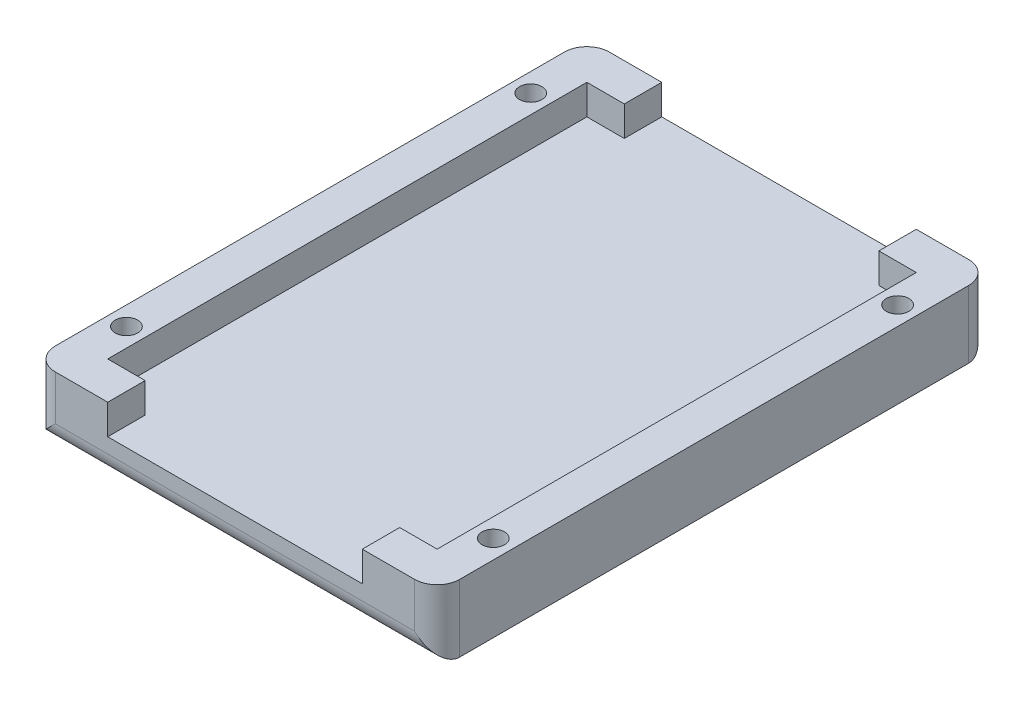
ISO-10303-21;
HEADER;
FILE_DESCRIPTION(('STEP AP214'),'2;1');
FILE_NAME('part.step','',(''),(''),'','','');
FILE_SCHEMA(('AUTOMOTIVE_DESIGN { 1 0 10303 214 1 1 1 1 }'));
ENDSEC;
DATA;
#1=APPLICATION_CONTEXT('core data for automotive mechanical design processes');
#2=APPLICATION_PROTOCOL_DEFINITION('international standard','automotive_design',2000,#1);
#3=PRODUCT_CONTEXT('',#1,'mechanical');
#4=PRODUCT('Part','Part','',(#3));
#5=PRODUCT_RELATED_PRODUCT_CATEGORY('part','',(#4));
#6=PRODUCT_DEFINITION_FORMATION('','',#4);
#7=PRODUCT_DEFINITION_CONTEXT('part definition',#1,'design');
#8=PRODUCT_DEFINITION('design','',#6,#7);
#9=PRODUCT_DEFINITION_SHAPE('','',#8);
#10=(LENGTH_UNIT() NAMED_UNIT(*) SI_UNIT(.MILLI.,.METRE.));
#11=(NAMED_UNIT(*) PLANE_ANGLE_UNIT() SI_UNIT($,.RADIAN.));
#12=(NAMED_UNIT(*) SI_UNIT($,.STERADIAN.) SOLID_ANGLE_UNIT());
#13=UNCERTAINTY_MEASURE_WITH_UNIT(LENGTH_MEASURE(1.E-05),#10,'distance_accuracy_value','');
#14=(GEOMETRIC_REPRESENTATION_CONTEXT(3) GLOBAL_UNCERTAINTY_ASSIGNED_CONTEXT((#13)) GLOBAL_UNIT_ASSIGNED_CONTEXT((#10,
#11,#12)) REPRESENTATION_CONTEXT('',''));
#15=CARTESIAN_POINT('',(0.,0.,0.));
#16=DIRECTION('',(0.,0.,1.));
#17=DIRECTION('',(1.,0.,0.));
#18=AXIS2_PLACEMENT_3D('',#15,#16,#17);
#19=CARTESIAN_POINT('',(-27.,5.,-37.));
#20=DIRECTION('',(0.,0.,1.));
#21=DIRECTION('',(1.,0.,0.));
#22=AXIS2_PLACEMENT_3D('',#19,#20,#21);
#23=PLANE('',#22);
#24=DIRECTION('',(-1.,0.,0.));
#25=VECTOR('',#24,1.);
#26=CARTESIAN_POINT('',(-27.,9.,-37.));
#27=LINE('',#26,#25);
#28=CARTESIAN_POINT('',(24.,9.,-37.));
#29=VERTEX_POINT('',#28);
#30=CARTESIAN_POINT('',(17.,9.,-37.));
#31=VERTEX_POINT('',#30);
#32=EDGE_CURVE('E278',#29,#31,#27,.T.);
#33=ORIENTED_EDGE('',*,*,#32,.F.);
#34=DIRECTION('',(0.,-1.,0.));
#35=VECTOR('',#34,1.);
#36=CARTESIAN_POINT('',(24.,5.,-37.));
#37=LINE('',#36,#35);
#38=CARTESIAN_POINT('',(24.,3.,-37.));
#39=VERTEX_POINT('',#38);
#40=EDGE_CURVE('E317',#29,#39,#37,.T.);
#41=ORIENTED_EDGE('',*,*,#40,.T.);
#42=DIRECTION('',(-1.,0.,0.));
#43=VECTOR('',#42,1.);
#44=CARTESIAN_POINT('',(-27.,3.,-37.));
#45=LINE('',#44,#43);
#46=CARTESIAN_POINT('',(-24.,3.,-37.));
#47=VERTEX_POINT('',#46);
#48=EDGE_CURVE('E313',#39,#47,#45,.T.);
#49=ORIENTED_EDGE('',*,*,#48,.T.);
#50=DIRECTION('',(0.,-1.,0.));
#51=VECTOR('',#50,1.);
#52=CARTESIAN_POINT('',(-24.,5.,-37.));
#53=LINE('',#52,#51);
#54=CARTESIAN_POINT('',(-24.,9.,-37.));
#55=VERTEX_POINT('',#54);
#56=EDGE_CURVE('E315',#47,#55,#53,.F.);
#57=ORIENTED_EDGE('',*,*,#56,.T.);
#58=CARTESIAN_POINT('',(-17.,9.,-37.));
#59=VERTEX_POINT('',#58);
#60=EDGE_CURVE('E277',#59,#55,#27,.T.);
#61=ORIENTED_EDGE('',*,*,#60,.F.);
#62=DIRECTION('',(0.,1.,0.));
#63=VECTOR('',#62,1.);
#64=CARTESIAN_POINT('',(-17.,5.00000000000002,-37.));
#65=LINE('',#64,#63);
#66=CARTESIAN_POINT('',(-17.,5.,-37.));
#67=VERTEX_POINT('',#66);
#68=EDGE_CURVE('E235',#67,#59,#65,.T.);
#69=ORIENTED_EDGE('',*,*,#68,.F.);
#70=DIRECTION('',(1.,0.,0.));
#71=VECTOR('',#70,1.);
#72=CARTESIAN_POINT('',(-27.,5.,-37.));
#73=LINE('',#72,#71);
#74=CARTESIAN_POINT('',(17.,5.,-37.));
#75=VERTEX_POINT('',#74);
#76=EDGE_CURVE('E237',#67,#75,#73,.T.);
#77=ORIENTED_EDGE('',*,*,#76,.T.);
#78=DIRECTION('',(0.,1.,0.));
#79=VECTOR('',#78,1.);
#80=CARTESIAN_POINT('',(17.,5.00000000000004,-37.));
#81=LINE('',#80,#79);
#82=EDGE_CURVE('E227',#75,#31,#81,.T.);
#83=ORIENTED_EDGE('',*,*,#82,.T.);
#84=EDGE_LOOP('',(#33,#41,#49,#57,#61,#69,#77,#83));
#85=FACE_BOUND('',#84,.T.);
#86=ADVANCED_FACE('F42',(#85),#23,.F.);
#87=CARTESIAN_POINT('',(-27.,5.,37.));
#88=DIRECTION('',(0.,0.,-1.));
#89=DIRECTION('',(-1.,0.,0.));
#90=AXIS2_PLACEMENT_3D('',#87,#88,#89);
#91=PLANE('',#90);
#92=DIRECTION('',(1.,0.,0.));
#93=VECTOR('',#92,1.);
#94=CARTESIAN_POINT('',(27.,3.,37.));
#95=LINE('',#94,#93);
#96=CARTESIAN_POINT('',(-24.,3.,37.));
#97=VERTEX_POINT('',#96);
#98=CARTESIAN_POINT('',(24.,3.,37.));
#99=VERTEX_POINT('',#98);
#100=EDGE_CURVE('E303',#97,#99,#95,.T.);
#101=ORIENTED_EDGE('',*,*,#100,.T.);
#102=DIRECTION('',(0.,-1.,0.));
#103=VECTOR('',#102,1.);
#104=CARTESIAN_POINT('',(24.,5.,37.));
#105=LINE('',#104,#103);
#106=CARTESIAN_POINT('',(24.,9.,37.));
#107=VERTEX_POINT('',#106);
#108=EDGE_CURVE('E307',#99,#107,#105,.F.);
#109=ORIENTED_EDGE('',*,*,#108,.T.);
#110=DIRECTION('',(1.,0.,0.));
#111=VECTOR('',#110,1.);
#112=CARTESIAN_POINT('',(-27.,9.,37.));
#113=LINE('',#112,#111);
#114=CARTESIAN_POINT('',(17.,9.,37.));
#115=VERTEX_POINT('',#114);
#116=EDGE_CURVE('E282',#115,#107,#113,.T.);
#117=ORIENTED_EDGE('',*,*,#116,.F.);
#118=DIRECTION('',(0.,1.,0.));
#119=VECTOR('',#118,1.);
#120=CARTESIAN_POINT('',(17.,0.,37.));
#121=LINE('',#120,#119);
#122=CARTESIAN_POINT('',(17.,5.,37.));
#123=VERTEX_POINT('',#122);
#124=EDGE_CURVE('E195',#123,#115,#121,.T.);
#125=ORIENTED_EDGE('',*,*,#124,.F.);
#126=DIRECTION('',(1.,0.,0.));
#127=VECTOR('',#126,1.);
#128=CARTESIAN_POINT('',(0.,5.,37.));
#129=LINE('',#128,#127);
#130=CARTESIAN_POINT('',(-17.,5.,37.));
#131=VERTEX_POINT('',#130);
#132=EDGE_CURVE('E187',#131,#123,#129,.T.);
#133=ORIENTED_EDGE('',*,*,#132,.F.);
#134=DIRECTION('',(0.,1.,0.));
#135=VECTOR('',#134,1.);
#136=CARTESIAN_POINT('',(-17.,0.,37.));
#137=LINE('',#136,#135);
#138=CARTESIAN_POINT('',(-17.,9.,37.));
#139=VERTEX_POINT('',#138);
#140=EDGE_CURVE('E199',#131,#139,#137,.T.);
#141=ORIENTED_EDGE('',*,*,#140,.T.);
#142=CARTESIAN_POINT('',(-24.,9.,37.));
#143=VERTEX_POINT('',#142);
#144=EDGE_CURVE('E283',#143,#139,#113,.T.);
#145=ORIENTED_EDGE('',*,*,#144,.F.);
#146=DIRECTION('',(0.,-1.,0.));
#147=VECTOR('',#146,1.);
#148=CARTESIAN_POINT('',(-24.,5.,37.));
#149=LINE('',#148,#147);
#150=EDGE_CURVE('E305',#143,#97,#149,.T.);
#151=ORIENTED_EDGE('',*,*,#150,.T.);
#152=EDGE_LOOP('',(#101,#109,#117,#125,#133,#141,#145,#151));
#153=FACE_BOUND('',#152,.T.);
#154=ADVANCED_FACE('F207',(#153),#91,.F.);
#155=CARTESIAN_POINT('',(0.,9.,0.));
#156=DIRECTION('',(0.,-1.,0.));
#157=DIRECTION('',(0.,0.,-1.));
#158=AXIS2_PLACEMENT_3D('',#155,#156,#157);
#159=PLANE('',#158);
#160=CARTESIAN_POINT('',(-24.5,9.,27.));
#161=DIRECTION('',(0.,1.,0.));
#162=DIRECTION('',(0.,0.,1.));
#163=AXIS2_PLACEMENT_3D('',#160,#161,#162);
#164=CIRCLE('',#163,1.5);
#165=CARTESIAN_POINT('',(-24.5,9.,28.5));
#166=VERTEX_POINT('',#165);
#167=EDGE_CURVE('E295',#166,#166,#164,.T.);
#168=ORIENTED_EDGE('',*,*,#167,.F.);
#169=EDGE_LOOP('',(#168));
#170=FACE_BOUND('',#169,.T.);
#171=CARTESIAN_POINT('',(-24.5000000000001,9.,-27.));
#172=DIRECTION('',(0.,1.,0.));
#173=DIRECTION('',(0.,0.,-1.));
#174=AXIS2_PLACEMENT_3D('',#171,#172,#173);
#175=CIRCLE('',#174,1.5);
#176=CARTESIAN_POINT('',(-24.5000000000001,9.,-28.5));
#177=VERTEX_POINT('',#176);
#178=EDGE_CURVE('E331',#177,#177,#175,.T.);
#179=ORIENTED_EDGE('',*,*,#178,.F.);
#180=EDGE_LOOP('',(#179));
#181=FACE_BOUND('',#180,.T.);
#182=ORIENTED_EDGE('',*,*,#60,.T.);
#183=CARTESIAN_POINT('',(-24.,9.,-34.));
#184=DIRECTION('',(0.,-1.,0.));
#185=DIRECTION('',(0.,0.,-1.));
#186=AXIS2_PLACEMENT_3D('',#183,#184,#185);
#187=CIRCLE('',#186,3.);
#188=CARTESIAN_POINT('',(-27.,9.,-34.));
#189=VERTEX_POINT('',#188);
#190=EDGE_CURVE('E66',#55,#189,#187,.F.);
#191=ORIENTED_EDGE('',*,*,#190,.T.);
#192=DIRECTION('',(0.,0.,1.));
#193=VECTOR('',#192,1.);
#194=CARTESIAN_POINT('',(-27.,9.,37.));
#195=LINE('',#194,#193);
#196=CARTESIAN_POINT('',(-27.,9.,34.));
#197=VERTEX_POINT('',#196);
#198=EDGE_CURVE('E280',#189,#197,#195,.T.);
#199=ORIENTED_EDGE('',*,*,#198,.T.);
#200=CARTESIAN_POINT('',(-24.,9.,34.));
#201=DIRECTION('',(0.,-1.,0.));
#202=DIRECTION('',(0.,0.,-1.));
#203=AXIS2_PLACEMENT_3D('',#200,#201,#202);
#204=CIRCLE('',#203,3.);
#205=EDGE_CURVE('E323',#197,#143,#204,.F.);
#206=ORIENTED_EDGE('',*,*,#205,.T.);
#207=ORIENTED_EDGE('',*,*,#144,.T.);
#208=DIRECTION('',(0.,0.,1.));
#209=VECTOR('',#208,1.);
#210=CARTESIAN_POINT('',(-17.,9.,-98.5));
#211=LINE('',#210,#209);
#212=CARTESIAN_POINT('',(-17.,9.,32.));
#213=VERTEX_POINT('',#212);
#214=EDGE_CURVE('E202',#213,#139,#211,.T.);
#215=ORIENTED_EDGE('',*,*,#214,.F.);
#216=DIRECTION('',(1.,0.,0.));
#217=VECTOR('',#216,1.);
#218=CARTESIAN_POINT('',(-22.,9.,32.));
#219=LINE('',#218,#217);
#220=CARTESIAN_POINT('',(-22.,9.,32.));
#221=VERTEX_POINT('',#220);
#222=EDGE_CURVE('E251',#221,#213,#219,.T.);
#223=ORIENTED_EDGE('',*,*,#222,.F.);
#224=DIRECTION('',(0.,0.,1.));
#225=VECTOR('',#224,1.);
#226=CARTESIAN_POINT('',(-22.,9.,32.));
#227=LINE('',#226,#225);
#228=CARTESIAN_POINT('',(-22.,9.,-32.));
#229=VERTEX_POINT('',#228);
#230=EDGE_CURVE('E247',#229,#221,#227,.T.);
#231=ORIENTED_EDGE('',*,*,#230,.F.);
#232=DIRECTION('',(-1.,0.,0.));
#233=VECTOR('',#232,1.);
#234=CARTESIAN_POINT('',(-22.,9.,-32.));
#235=LINE('',#234,#233);
#236=CARTESIAN_POINT('',(-17.,9.,-32.));
#237=VERTEX_POINT('',#236);
#238=EDGE_CURVE('E243',#237,#229,#235,.T.);
#239=ORIENTED_EDGE('',*,*,#238,.F.);
#240=EDGE_CURVE('E214',#59,#237,#211,.T.);
#241=ORIENTED_EDGE('',*,*,#240,.F.);
#242=EDGE_LOOP('',(#182,#191,#199,#206,#207,#215,#223,#231,#239,#241));
#243=FACE_BOUND('',#242,.T.);
#244=ADVANCED_FACE('F351',(#170,#181,#243),#159,.F.);
#245=CARTESIAN_POINT('',(-22.,9.,-32.));
#246=DIRECTION('',(0.,0.,1.));
#247=DIRECTION('',(1.,0.,0.));
#248=AXIS2_PLACEMENT_3D('',#245,#246,#247);
#249=PLANE('',#248);
#250=DIRECTION('',(-1.,0.,0.));
#251=VECTOR('',#250,1.);
#252=CARTESIAN_POINT('',(-22.,5.,-32.));
#253=LINE('',#252,#251);
#254=CARTESIAN_POINT('',(-17.,5.,-32.));
#255=VERTEX_POINT('',#254);
#256=CARTESIAN_POINT('',(-22.,5.,-32.));
#257=VERTEX_POINT('',#256);
#258=EDGE_CURVE('E257',#255,#257,#253,.T.);
#259=ORIENTED_EDGE('',*,*,#258,.F.);
#260=DIRECTION('',(0.,1.,0.));
#261=VECTOR('',#260,1.);
#262=CARTESIAN_POINT('',(-17.,9.00000000000001,-32.));
#263=LINE('',#262,#261);
#264=EDGE_CURVE('E232',#255,#237,#263,.T.);
#265=ORIENTED_EDGE('',*,*,#264,.T.);
#266=ORIENTED_EDGE('',*,*,#238,.T.);
#267=DIRECTION('',(0.,-1.,0.));
#268=VECTOR('',#267,1.);
#269=CARTESIAN_POINT('',(-22.,9.,-32.));
#270=LINE('',#269,#268);
#271=EDGE_CURVE('E268',#229,#257,#270,.T.);
#272=ORIENTED_EDGE('',*,*,#271,.T.);
#273=EDGE_LOOP('',(#259,#265,#266,#272));
#274=FACE_BOUND('',#273,.T.);
#275=ADVANCED_FACE('F360',(#274),#249,.T.);
#276=CARTESIAN_POINT('',(-22.,9.,32.));
#277=DIRECTION('',(0.,0.,-1.));
#278=DIRECTION('',(-1.,0.,0.));
#279=AXIS2_PLACEMENT_3D('',#276,#277,#278);
#280=PLANE('',#279);
#281=ORIENTED_EDGE('',*,*,#222,.T.);
#282=DIRECTION('',(0.,-1.,0.));
#283=VECTOR('',#282,1.);
#284=CARTESIAN_POINT('',(-17.,9.00000000000001,32.));
#285=LINE('',#284,#283);
#286=CARTESIAN_POINT('',(-17.,5.,32.));
#287=VERTEX_POINT('',#286);
#288=EDGE_CURVE('E230',#213,#287,#285,.T.);
#289=ORIENTED_EDGE('',*,*,#288,.T.);
#290=DIRECTION('',(1.,0.,0.));
#291=VECTOR('',#290,1.);
#292=CARTESIAN_POINT('',(-22.,5.,32.));
#293=LINE('',#292,#291);
#294=CARTESIAN_POINT('',(-22.,5.,32.));
#295=VERTEX_POINT('',#294);
#296=EDGE_CURVE('E191',#295,#287,#293,.T.);
#297=ORIENTED_EDGE('',*,*,#296,.F.);
#298=DIRECTION('',(0.,-1.,0.));
#299=VECTOR('',#298,1.);
#300=CARTESIAN_POINT('',(-22.,9.,32.));
#301=LINE('',#300,#299);
#302=EDGE_CURVE('E266',#221,#295,#301,.T.);
#303=ORIENTED_EDGE('',*,*,#302,.F.);
#304=EDGE_LOOP('',(#281,#289,#297,#303));
#305=FACE_BOUND('',#304,.T.);
#306=ADVANCED_FACE('F416',(#305),#280,.T.);
#307=CARTESIAN_POINT('',(27.,5.,37.));
#308=DIRECTION('',(-1.,0.,0.));
#309=DIRECTION('',(0.,0.,1.));
#310=AXIS2_PLACEMENT_3D('',#307,#308,#309);
#311=PLANE('',#310);
#312=DIRECTION('',(0.,0.,-1.));
#313=VECTOR('',#312,1.);
#314=CARTESIAN_POINT('',(27.,9.,37.));
#315=LINE('',#314,#313);
#316=CARTESIAN_POINT('',(27.,9.,34.));
#317=VERTEX_POINT('',#316);
#318=CARTESIAN_POINT('',(27.,9.,-34.));
#319=VERTEX_POINT('',#318);
#320=EDGE_CURVE('E274',#317,#319,#315,.T.);
#321=ORIENTED_EDGE('',*,*,#320,.F.);
#322=DIRECTION('',(0.,-1.,0.));
#323=VECTOR('',#322,1.);
#324=CARTESIAN_POINT('',(27.,5.,34.));
#325=LINE('',#324,#323);
#326=CARTESIAN_POINT('',(27.,0.,34.));
#327=VERTEX_POINT('',#326);
#328=EDGE_CURVE('E300',#317,#327,#325,.T.);
#329=ORIENTED_EDGE('',*,*,#328,.T.);
#330=DIRECTION('',(0.,0.,-1.));
#331=VECTOR('',#330,1.);
#332=CARTESIAN_POINT('',(27.,0.,37.));
#333=LINE('',#332,#331);
#334=CARTESIAN_POINT('',(27.,0.,-34.));
#335=VERTEX_POINT('',#334);
#336=EDGE_CURVE('E285',#327,#335,#333,.T.);
#337=ORIENTED_EDGE('',*,*,#336,.T.);
#338=DIRECTION('',(0.,-1.,0.));
#339=VECTOR('',#338,1.);
#340=CARTESIAN_POINT('',(27.,5.,-34.));
#341=LINE('',#340,#339);
#342=EDGE_CURVE('E290',#335,#319,#341,.F.);
#343=ORIENTED_EDGE('',*,*,#342,.T.);
#344=EDGE_LOOP('',(#321,#329,#337,#343));
#345=FACE_BOUND('',#344,.T.);
#346=ADVANCED_FACE('F386',(#345),#311,.F.);
#347=CARTESIAN_POINT('',(-27.,5.,37.));
#348=DIRECTION('',(1.,0.,0.));
#349=DIRECTION('',(0.,0.,-1.));
#350=AXIS2_PLACEMENT_3D('',#347,#348,#349);
#351=PLANE('',#350);
#352=ORIENTED_EDGE('',*,*,#198,.F.);
#353=DIRECTION('',(0.,-1.,0.));
#354=VECTOR('',#353,1.);
#355=CARTESIAN_POINT('',(-27.,5.,-34.));
#356=LINE('',#355,#354);
#357=CARTESIAN_POINT('',(-27.,0.,-34.));
#358=VERTEX_POINT('',#357);
#359=EDGE_CURVE('E321',#189,#358,#356,.T.);
#360=ORIENTED_EDGE('',*,*,#359,.T.);
#361=DIRECTION('',(0.,0.,1.));
#362=VECTOR('',#361,1.);
#363=CARTESIAN_POINT('',(-27.,0.,37.));
#364=LINE('',#363,#362);
#365=CARTESIAN_POINT('',(-27.,0.,34.));
#366=VERTEX_POINT('',#365);
#367=EDGE_CURVE('E288',#358,#366,#364,.T.);
#368=ORIENTED_EDGE('',*,*,#367,.T.);
#369=DIRECTION('',(0.,-1.,0.));
#370=VECTOR('',#369,1.);
#371=CARTESIAN_POINT('',(-27.,5.,34.));
#372=LINE('',#371,#370);
#373=EDGE_CURVE('E59',#366,#197,#372,.F.);
#374=ORIENTED_EDGE('',*,*,#373,.T.);
#375=EDGE_LOOP('',(#352,#360,#368,#374));
#376=FACE_BOUND('',#375,.T.);
#377=ADVANCED_FACE('F393',(#376),#351,.F.);
#378=CARTESIAN_POINT('',(0.,0.,0.));
#379=DIRECTION('',(0.,-1.,0.));
#380=DIRECTION('',(0.,0.,-1.));
#381=AXIS2_PLACEMENT_3D('',#378,#379,#380);
#382=PLANE('',#381);
#383=CARTESIAN_POINT('',(-24.5,0.,27.));
#384=DIRECTION('',(0.,-1.,0.));
#385=DIRECTION('',(0.,0.,-1.));
#386=AXIS2_PLACEMENT_3D('',#383,#384,#385);
#387=CIRCLE('',#386,1.5);
#388=CARTESIAN_POINT('',(-24.5,0.,25.5));
#389=VERTEX_POINT('',#388);
#390=EDGE_CURVE('E294',#389,#389,#387,.T.);
#391=ORIENTED_EDGE('',*,*,#390,.F.);
#392=EDGE_LOOP('',(#391));
#393=FACE_BOUND('',#392,.T.);
#394=CARTESIAN_POINT('',(-24.5000000000001,0.,-27.));
#395=DIRECTION('',(0.,-1.,0.));
#396=DIRECTION('',(0.,0.,-1.));
#397=AXIS2_PLACEMENT_3D('',#394,#395,#396);
#398=CIRCLE('',#397,1.5);
#399=CARTESIAN_POINT('',(-24.5000000000001,0.,-28.5));
#400=VERTEX_POINT('',#399);
#401=EDGE_CURVE('E291',#400,#400,#398,.T.);
#402=ORIENTED_EDGE('',*,*,#401,.F.);
#403=EDGE_LOOP('',(#402));
#404=FACE_BOUND('',#403,.T.);
#405=CARTESIAN_POINT('',(24.5,0.,27.));
#406=DIRECTION('',(0.,-1.,0.));
#407=DIRECTION('',(0.,0.,-1.));
#408=AXIS2_PLACEMENT_3D('',#405,#406,#407);
#409=CIRCLE('',#408,1.5);
#410=CARTESIAN_POINT('',(24.5,0.,25.5));
#411=VERTEX_POINT('',#410);
#412=EDGE_CURVE('E205',#411,#411,#409,.T.);
#413=ORIENTED_EDGE('',*,*,#412,.F.);
#414=EDGE_LOOP('',(#413));
#415=FACE_BOUND('',#414,.T.);
#416=CARTESIAN_POINT('',(24.5000000000001,0.,-27.));
#417=DIRECTION('',(0.,-1.,0.));
#418=DIRECTION('',(0.,0.,-1.));
#419=AXIS2_PLACEMENT_3D('',#416,#417,#418);
#420=CIRCLE('',#419,1.5);
#421=CARTESIAN_POINT('',(24.5000000000001,0.,-28.5));
#422=VERTEX_POINT('',#421);
#423=EDGE_CURVE('E784',#422,#422,#420,.T.);
#424=ORIENTED_EDGE('',*,*,#423,.F.);
#425=EDGE_LOOP('',(#424));
#426=FACE_BOUND('',#425,.T.);
#427=ORIENTED_EDGE('',*,*,#336,.F.);
#428=DIRECTION('',(1.,0.,0.));
#429=VECTOR('',#428,1.);
#430=CARTESIAN_POINT('',(-27.,0.,34.));
#431=LINE('',#430,#429);
#432=EDGE_CURVE('E11',#327,#366,#431,.F.);
#433=ORIENTED_EDGE('',*,*,#432,.T.);
#434=ORIENTED_EDGE('',*,*,#367,.F.);
#435=DIRECTION('',(-1.,0.,0.));
#436=VECTOR('',#435,1.);
#437=CARTESIAN_POINT('',(27.,0.,-34.));
#438=LINE('',#437,#436);
#439=EDGE_CURVE('E51',#358,#335,#438,.F.);
#440=ORIENTED_EDGE('',*,*,#439,.T.);
#441=EDGE_LOOP('',(#427,#433,#434,#440));
#442=FACE_BOUND('',#441,.T.);
#443=ADVANCED_FACE('F390',(#393,#404,#415,#426,#442),#382,.T.);
#444=CARTESIAN_POINT('',(24.5,9.,27.));
#445=DIRECTION('',(0.,1.,0.));
#446=DIRECTION('',(0.,0.,1.));
#447=AXIS2_PLACEMENT_3D('',#444,#445,#446);
#448=CIRCLE('',#447,1.5);
#449=CARTESIAN_POINT('',(24.5,9.,28.5));
#450=VERTEX_POINT('',#449);
#451=EDGE_CURVE('E781',#450,#450,#448,.T.);
#452=ORIENTED_EDGE('',*,*,#451,.F.);
#453=EDGE_LOOP('',(#452));
#454=FACE_BOUND('',#453,.T.);
#455=CARTESIAN_POINT('',(24.5000000000001,9.,-27.));
#456=DIRECTION('',(0.,1.,0.));
#457=DIRECTION('',(0.,0.,-1.));
#458=AXIS2_PLACEMENT_3D('',#455,#456,#457);
#459=CIRCLE('',#458,1.5);
#460=CARTESIAN_POINT('',(24.5000000000001,9.,-28.5));
#461=VERTEX_POINT('',#460);
#462=EDGE_CURVE('E298',#461,#461,#459,.T.);
#463=ORIENTED_EDGE('',*,*,#462,.F.);
#464=EDGE_LOOP('',(#463));
#465=FACE_BOUND('',#464,.T.);
#466=ORIENTED_EDGE('',*,*,#116,.T.);
#467=CARTESIAN_POINT('',(24.,9.,34.));
#468=DIRECTION('',(0.,-1.,0.));
#469=DIRECTION('',(0.,0.,-1.));
#470=AXIS2_PLACEMENT_3D('',#467,#468,#469);
#471=CIRCLE('',#470,3.);
#472=EDGE_CURVE('E311',#107,#317,#471,.F.);
#473=ORIENTED_EDGE('',*,*,#472,.T.);
#474=ORIENTED_EDGE('',*,*,#320,.T.);
#475=CARTESIAN_POINT('',(24.,9.,-34.));
#476=DIRECTION('',(0.,-1.,0.));
#477=DIRECTION('',(0.,0.,-1.));
#478=AXIS2_PLACEMENT_3D('',#475,#476,#477);
#479=CIRCLE('',#478,3.);
#480=EDGE_CURVE('E309',#319,#29,#479,.F.);
#481=ORIENTED_EDGE('',*,*,#480,.T.);
#482=ORIENTED_EDGE('',*,*,#32,.T.);
#483=DIRECTION('',(0.,0.,1.));
#484=VECTOR('',#483,1.);
#485=CARTESIAN_POINT('',(17.,9.,-98.5));
#486=LINE('',#485,#484);
#487=CARTESIAN_POINT('',(17.,9.,-32.));
#488=VERTEX_POINT('',#487);
#489=EDGE_CURVE('E215',#31,#488,#486,.T.);
#490=ORIENTED_EDGE('',*,*,#489,.T.);
#491=CARTESIAN_POINT('',(22.,9.,-32.));
#492=VERTEX_POINT('',#491);
#493=EDGE_CURVE('E244',#492,#488,#235,.T.);
#494=ORIENTED_EDGE('',*,*,#493,.F.);
#495=DIRECTION('',(0.,0.,-1.));
#496=VECTOR('',#495,1.);
#497=CARTESIAN_POINT('',(22.,9.,32.));
#498=LINE('',#497,#496);
#499=CARTESIAN_POINT('',(22.,9.,32.));
#500=VERTEX_POINT('',#499);
#501=EDGE_CURVE('E241',#500,#492,#498,.T.);
#502=ORIENTED_EDGE('',*,*,#501,.F.);
#503=CARTESIAN_POINT('',(17.,9.,32.));
#504=VERTEX_POINT('',#503);
#505=EDGE_CURVE('E250',#504,#500,#219,.T.);
#506=ORIENTED_EDGE('',*,*,#505,.F.);
#507=EDGE_CURVE('E216',#504,#115,#486,.T.);
#508=ORIENTED_EDGE('',*,*,#507,.T.);
#509=EDGE_LOOP('',(#466,#473,#474,#481,#482,#490,#494,#502,#506,#508));
#510=FACE_BOUND('',#509,.T.);
#511=ADVANCED_FACE('F381',(#454,#465,#510),#159,.F.);
#512=CARTESIAN_POINT('',(22.,9.,32.));
#513=DIRECTION('',(-1.,0.,0.));
#514=DIRECTION('',(0.,0.,1.));
#515=AXIS2_PLACEMENT_3D('',#512,#513,#514);
#516=PLANE('',#515);
#517=DIRECTION('',(0.,0.,-1.));
#518=VECTOR('',#517,1.);
#519=CARTESIAN_POINT('',(22.,5.,32.));
#520=LINE('',#519,#518);
#521=CARTESIAN_POINT('',(22.,5.,32.));
#522=VERTEX_POINT('',#521);
#523=CARTESIAN_POINT('',(22.,5.,-32.));
#524=VERTEX_POINT('',#523);
#525=EDGE_CURVE('E240',#522,#524,#520,.T.);
#526=ORIENTED_EDGE('',*,*,#525,.F.);
#527=DIRECTION('',(0.,-1.,0.));
#528=VECTOR('',#527,1.);
#529=CARTESIAN_POINT('',(22.,9.,32.));
#530=LINE('',#529,#528);
#531=EDGE_CURVE('E254',#500,#522,#530,.T.);
#532=ORIENTED_EDGE('',*,*,#531,.F.);
#533=ORIENTED_EDGE('',*,*,#501,.T.);
#534=DIRECTION('',(0.,-1.,0.));
#535=VECTOR('',#534,1.);
#536=CARTESIAN_POINT('',(22.,9.,-32.));
#537=LINE('',#536,#535);
#538=EDGE_CURVE('E271',#492,#524,#537,.T.);
#539=ORIENTED_EDGE('',*,*,#538,.T.);
#540=EDGE_LOOP('',(#526,#532,#533,#539));
#541=FACE_BOUND('',#540,.T.);
#542=ADVANCED_FACE('F375',(#541),#516,.T.);
#543=DIRECTION('',(0.,1.,0.));
#544=VECTOR('',#543,1.);
#545=CARTESIAN_POINT('',(17.,9.00000000000003,-32.));
#546=LINE('',#545,#544);
#547=CARTESIAN_POINT('',(17.,5.,-32.));
#548=VERTEX_POINT('',#547);
#549=EDGE_CURVE('E225',#548,#488,#546,.T.);
#550=ORIENTED_EDGE('',*,*,#549,.F.);
#551=EDGE_CURVE('E258',#524,#548,#253,.T.);
#552=ORIENTED_EDGE('',*,*,#551,.F.);
#553=ORIENTED_EDGE('',*,*,#538,.F.);
#554=ORIENTED_EDGE('',*,*,#493,.T.);
#555=EDGE_LOOP('',(#550,#552,#553,#554));
#556=FACE_BOUND('',#555,.T.);
#557=ADVANCED_FACE('F372',(#556),#249,.T.);
#558=CARTESIAN_POINT('',(-22.,9.,32.));
#559=DIRECTION('',(1.,0.,0.));
#560=DIRECTION('',(0.,0.,-1.));
#561=AXIS2_PLACEMENT_3D('',#558,#559,#560);
#562=PLANE('',#561);
#563=DIRECTION('',(0.,0.,1.));
#564=VECTOR('',#563,1.);
#565=CARTESIAN_POINT('',(-22.,5.,32.));
#566=LINE('',#565,#564);
#567=EDGE_CURVE('E260',#257,#295,#566,.T.);
#568=ORIENTED_EDGE('',*,*,#567,.F.);
#569=ORIENTED_EDGE('',*,*,#271,.F.);
#570=ORIENTED_EDGE('',*,*,#230,.T.);
#571=ORIENTED_EDGE('',*,*,#302,.T.);
#572=EDGE_LOOP('',(#568,#569,#570,#571));
#573=FACE_BOUND('',#572,.T.);
#574=ADVANCED_FACE('F414',(#573),#562,.T.);
#575=DIRECTION('',(0.,-1.,0.));
#576=VECTOR('',#575,1.);
#577=CARTESIAN_POINT('',(17.,9.00000000000003,32.));
#578=LINE('',#577,#576);
#579=CARTESIAN_POINT('',(17.,5.,32.));
#580=VERTEX_POINT('',#579);
#581=EDGE_CURVE('E222',#504,#580,#578,.T.);
#582=ORIENTED_EDGE('',*,*,#581,.F.);
#583=ORIENTED_EDGE('',*,*,#505,.T.);
#584=ORIENTED_EDGE('',*,*,#531,.T.);
#585=EDGE_CURVE('E262',#580,#522,#293,.T.);
#586=ORIENTED_EDGE('',*,*,#585,.F.);
#587=EDGE_LOOP('',(#582,#583,#584,#586));
#588=FACE_BOUND('',#587,.T.);
#589=ADVANCED_FACE('F412',(#588),#280,.T.);
#590=CARTESIAN_POINT('',(0.,5.,0.));
#591=DIRECTION('',(0.,-1.,0.));
#592=DIRECTION('',(0.,0.,-1.));
#593=AXIS2_PLACEMENT_3D('',#590,#591,#592);
#594=PLANE('',#593);
#595=ORIENTED_EDGE('',*,*,#551,.T.);
#596=DIRECTION('',(0.,0.,1.));
#597=VECTOR('',#596,1.);
#598=CARTESIAN_POINT('',(17.,5.,-98.5));
#599=LINE('',#598,#597);
#600=EDGE_CURVE('E219',#75,#548,#599,.T.);
#601=ORIENTED_EDGE('',*,*,#600,.F.);
#602=ORIENTED_EDGE('',*,*,#76,.F.);
#603=DIRECTION('',(0.,0.,1.));
#604=VECTOR('',#603,1.);
#605=CARTESIAN_POINT('',(-17.,5.,-98.5));
#606=LINE('',#605,#604);
#607=EDGE_CURVE('E194',#67,#255,#606,.T.);
#608=ORIENTED_EDGE('',*,*,#607,.T.);
#609=ORIENTED_EDGE('',*,*,#258,.T.);
#610=ORIENTED_EDGE('',*,*,#567,.T.);
#611=ORIENTED_EDGE('',*,*,#296,.T.);
#612=EDGE_CURVE('E182',#287,#131,#606,.T.);
#613=ORIENTED_EDGE('',*,*,#612,.T.);
#614=ORIENTED_EDGE('',*,*,#132,.T.);
#615=EDGE_CURVE('E220',#580,#123,#599,.T.);
#616=ORIENTED_EDGE('',*,*,#615,.F.);
#617=ORIENTED_EDGE('',*,*,#585,.T.);
#618=ORIENTED_EDGE('',*,*,#525,.T.);
#619=EDGE_LOOP('',(#595,#601,#602,#608,#609,#610,#611,#613,#614,#616,#617,#618));
#620=FACE_BOUND('',#619,.T.);
#621=ADVANCED_FACE('F185',(#620),#594,.F.);
#622=CARTESIAN_POINT('',(17.,0.,-98.5));
#623=DIRECTION('',(1.,0.,0.));
#624=DIRECTION('',(0.,1.,0.));
#625=AXIS2_PLACEMENT_3D('',#622,#623,#624);
#626=PLANE('',#625);
#627=ORIENTED_EDGE('',*,*,#581,.T.);
#628=ORIENTED_EDGE('',*,*,#615,.T.);
#629=ORIENTED_EDGE('',*,*,#124,.T.);
#630=ORIENTED_EDGE('',*,*,#507,.F.);
#631=EDGE_LOOP('',(#627,#628,#629,#630));
#632=FACE_BOUND('',#631,.T.);
#633=ADVANCED_FACE('F409',(#632),#626,.F.);
#634=CARTESIAN_POINT('',(-17.,0.,-98.5));
#635=DIRECTION('',(1.,0.,0.));
#636=DIRECTION('',(0.,1.,0.));
#637=AXIS2_PLACEMENT_3D('',#634,#635,#636);
#638=PLANE('',#637);
#639=ORIENTED_EDGE('',*,*,#214,.T.);
#640=ORIENTED_EDGE('',*,*,#140,.F.);
#641=ORIENTED_EDGE('',*,*,#612,.F.);
#642=ORIENTED_EDGE('',*,*,#288,.F.);
#643=EDGE_LOOP('',(#639,#640,#641,#642));
#644=FACE_BOUND('',#643,.T.);
#645=ADVANCED_FACE('F200',(#644),#638,.T.);
#646=ORIENTED_EDGE('',*,*,#68,.T.);
#647=ORIENTED_EDGE('',*,*,#240,.T.);
#648=ORIENTED_EDGE('',*,*,#264,.F.);
#649=ORIENTED_EDGE('',*,*,#607,.F.);
#650=EDGE_LOOP('',(#646,#647,#648,#649));
#651=FACE_BOUND('',#650,.T.);
#652=ADVANCED_FACE('F356',(#651),#638,.T.);
#653=ORIENTED_EDGE('',*,*,#600,.T.);
#654=ORIENTED_EDGE('',*,*,#549,.T.);
#655=ORIENTED_EDGE('',*,*,#489,.F.);
#656=ORIENTED_EDGE('',*,*,#82,.F.);
#657=EDGE_LOOP('',(#653,#654,#655,#656));
#658=FACE_BOUND('',#657,.T.);
#659=ADVANCED_FACE('F366',(#658),#626,.F.);
#660=CARTESIAN_POINT('',(24.5000000000001,-126.5,-27.));
#661=DIRECTION('',(0.,1.,0.));
#662=DIRECTION('',(0.,0.,1.));
#663=AXIS2_PLACEMENT_3D('',#660,#661,#662);
#664=CYLINDRICAL_SURFACE('',#663,1.5);
#665=ORIENTED_EDGE('',*,*,#423,.T.);
#666=EDGE_LOOP('',(#665));
#667=FACE_BOUND('',#666,.T.);
#668=ORIENTED_EDGE('',*,*,#462,.T.);
#669=EDGE_LOOP('',(#668));
#670=FACE_BOUND('',#669,.T.);
#671=ADVANCED_FACE('F485',(#667,#670),#664,.F.);
#672=CARTESIAN_POINT('',(24.5,-126.5,27.));
#673=DIRECTION('',(0.,1.,0.));
#674=DIRECTION('',(0.,0.,1.));
#675=AXIS2_PLACEMENT_3D('',#672,#673,#674);
#676=CYLINDRICAL_SURFACE('',#675,1.5);
#677=ORIENTED_EDGE('',*,*,#412,.T.);
#678=EDGE_LOOP('',(#677));
#679=FACE_BOUND('',#678,.T.);
#680=ORIENTED_EDGE('',*,*,#451,.T.);
#681=EDGE_LOOP('',(#680));
#682=FACE_BOUND('',#681,.T.);
#683=ADVANCED_FACE('F477',(#679,#682),#676,.F.);
#684=CARTESIAN_POINT('',(-24.5000000000001,-126.5,-27.));
#685=DIRECTION('',(0.,1.,0.));
#686=DIRECTION('',(0.,0.,1.));
#687=AXIS2_PLACEMENT_3D('',#684,#685,#686);
#688=CYLINDRICAL_SURFACE('',#687,1.5);
#689=ORIENTED_EDGE('',*,*,#401,.T.);
#690=EDGE_LOOP('',(#689));
#691=FACE_BOUND('',#690,.T.);
#692=ORIENTED_EDGE('',*,*,#178,.T.);
#693=EDGE_LOOP('',(#692));
#694=FACE_BOUND('',#693,.T.);
#695=ADVANCED_FACE('F470',(#691,#694),#688,.F.);
#696=CARTESIAN_POINT('',(-24.5,-126.5,27.));
#697=DIRECTION('',(0.,1.,0.));
#698=DIRECTION('',(0.,0.,1.));
#699=AXIS2_PLACEMENT_3D('',#696,#697,#698);
#700=CYLINDRICAL_SURFACE('',#699,1.5);
#701=ORIENTED_EDGE('',*,*,#390,.T.);
#702=EDGE_LOOP('',(#701));
#703=FACE_BOUND('',#702,.T.);
#704=ORIENTED_EDGE('',*,*,#167,.T.);
#705=EDGE_LOOP('',(#704));
#706=FACE_BOUND('',#705,.T.);
#707=ADVANCED_FACE('F444',(#703,#706),#700,.F.);
#708=CARTESIAN_POINT('',(-24.,5.,34.));
#709=DIRECTION('',(0.,-1.,0.));
#710=DIRECTION('',(0.,0.,-1.));
#711=AXIS2_PLACEMENT_3D('',#708,#709,#710);
#712=CYLINDRICAL_SURFACE('',#711,3.);
#713=ORIENTED_EDGE('',*,*,#205,.F.);
#714=ORIENTED_EDGE('',*,*,#373,.F.);
#715=CARTESIAN_POINT('',(-24.,3.,34.));
#716=DIRECTION('',(-0.707106781186547,0.707106781186547,0.));
#717=DIRECTION('',(-0.707106781186547,-0.707106781186547,0.));
#718=AXIS2_PLACEMENT_3D('',#715,#716,#717);
#719=ELLIPSE('',#718,4.24264068711928,3.);
#720=EDGE_CURVE('E329',#97,#366,#719,.F.);
#721=ORIENTED_EDGE('',*,*,#720,.F.);
#722=ORIENTED_EDGE('',*,*,#150,.F.);
#723=EDGE_LOOP('',(#713,#714,#721,#722));
#724=FACE_BOUND('',#723,.T.);
#725=ADVANCED_FACE('F397',(#724),#712,.T.);
#726=CARTESIAN_POINT('',(-27.,3.,34.));
#727=DIRECTION('',(-1.,0.,0.));
#728=DIRECTION('',(0.,0.,1.));
#729=AXIS2_PLACEMENT_3D('',#726,#727,#728);
#730=CYLINDRICAL_SURFACE('',#729,3.);
#731=ORIENTED_EDGE('',*,*,#720,.T.);
#732=ORIENTED_EDGE('',*,*,#432,.F.);
#733=CARTESIAN_POINT('',(24.,3.,34.));
#734=DIRECTION('',(-0.707106781186547,-0.707106781186547,0.));
#735=DIRECTION('',(-0.707106781186547,0.707106781186547,0.));
#736=AXIS2_PLACEMENT_3D('',#733,#734,#735);
#737=ELLIPSE('',#736,4.24264068711928,3.);
#738=EDGE_CURVE('E327',#99,#327,#737,.F.);
#739=ORIENTED_EDGE('',*,*,#738,.F.);
#740=ORIENTED_EDGE('',*,*,#100,.F.);
#741=EDGE_LOOP('',(#731,#732,#739,#740));
#742=FACE_BOUND('',#741,.T.);
#743=ADVANCED_FACE('F401',(#742),#730,.T.);
#744=CARTESIAN_POINT('',(24.,5.,34.));
#745=DIRECTION('',(0.,-1.,0.));
#746=DIRECTION('',(0.,0.,-1.));
#747=AXIS2_PLACEMENT_3D('',#744,#745,#746);
#748=CYLINDRICAL_SURFACE('',#747,3.);
#749=ORIENTED_EDGE('',*,*,#472,.F.);
#750=ORIENTED_EDGE('',*,*,#108,.F.);
#751=ORIENTED_EDGE('',*,*,#738,.T.);
#752=ORIENTED_EDGE('',*,*,#328,.F.);
#753=EDGE_LOOP('',(#749,#750,#751,#752));
#754=FACE_BOUND('',#753,.T.);
#755=ADVANCED_FACE('F406',(#754),#748,.T.);
#756=CARTESIAN_POINT('',(-24.,5.,-34.));
#757=DIRECTION('',(0.,-1.,0.));
#758=DIRECTION('',(0.,0.,-1.));
#759=AXIS2_PLACEMENT_3D('',#756,#757,#758);
#760=CYLINDRICAL_SURFACE('',#759,3.);
#761=ORIENTED_EDGE('',*,*,#190,.F.);
#762=ORIENTED_EDGE('',*,*,#56,.F.);
#763=CARTESIAN_POINT('',(-24.,3.,-34.));
#764=DIRECTION('',(0.707106781186547,-0.707106781186547,0.));
#765=DIRECTION('',(0.707106781186547,0.707106781186547,0.));
#766=AXIS2_PLACEMENT_3D('',#763,#764,#765);
#767=ELLIPSE('',#766,4.24264068711928,3.);
#768=EDGE_CURVE('E46',#358,#47,#767,.T.);
#769=ORIENTED_EDGE('',*,*,#768,.F.);
#770=ORIENTED_EDGE('',*,*,#359,.F.);
#771=EDGE_LOOP('',(#761,#762,#769,#770));
#772=FACE_BOUND('',#771,.T.);
#773=ADVANCED_FACE('F44',(#772),#760,.T.);
#774=CARTESIAN_POINT('',(-27.,3.,-34.));
#775=DIRECTION('',(1.,0.,0.));
#776=DIRECTION('',(0.,0.,-1.));
#777=AXIS2_PLACEMENT_3D('',#774,#775,#776);
#778=CYLINDRICAL_SURFACE('',#777,3.);
#779=ORIENTED_EDGE('',*,*,#768,.T.);
#780=ORIENTED_EDGE('',*,*,#48,.F.);
#781=CARTESIAN_POINT('',(24.,3.,-34.));
#782=DIRECTION('',(0.707106781186547,0.707106781186547,0.));
#783=DIRECTION('',(0.707106781186547,-0.707106781186547,0.));
#784=AXIS2_PLACEMENT_3D('',#781,#782,#783);
#785=ELLIPSE('',#784,4.24264068711928,3.);
#786=EDGE_CURVE('E332',#335,#39,#785,.T.);
#787=ORIENTED_EDGE('',*,*,#786,.F.);
#788=ORIENTED_EDGE('',*,*,#439,.F.);
#789=EDGE_LOOP('',(#779,#780,#787,#788));
#790=FACE_BOUND('',#789,.T.);
#791=ADVANCED_FACE('F342',(#790),#778,.T.);
#792=CARTESIAN_POINT('',(24.,5.,-34.));
#793=DIRECTION('',(0.,-1.,0.));
#794=DIRECTION('',(0.,0.,-1.));
#795=AXIS2_PLACEMENT_3D('',#792,#793,#794);
#796=CYLINDRICAL_SURFACE('',#795,3.);
#797=ORIENTED_EDGE('',*,*,#480,.F.);
#798=ORIENTED_EDGE('',*,*,#342,.F.);
#799=ORIENTED_EDGE('',*,*,#786,.T.);
#800=ORIENTED_EDGE('',*,*,#40,.F.);
#801=EDGE_LOOP('',(#797,#798,#799,#800));
#802=FACE_BOUND('',#801,.T.);
#803=ADVANCED_FACE('F384',(#802),#796,.T.);
#804=CLOSED_SHELL('',(#86,#154,#244,#275,#306,#346,#377,#443,#511,#542,#557,#574,#589,#621,#633,
#645,#652,#659,#671,#683,#695,#707,#725,#743,#755,#773,#791,#803));
#805=MANIFOLD_SOLID_BREP('B2',#804);
#806=ADVANCED_BREP_SHAPE_REPRESENTATION('',(#18,#805),#14);
#807=SHAPE_DEFINITION_REPRESENTATION(#9,#806);
ENDSEC;
END-ISO-10303-21;
